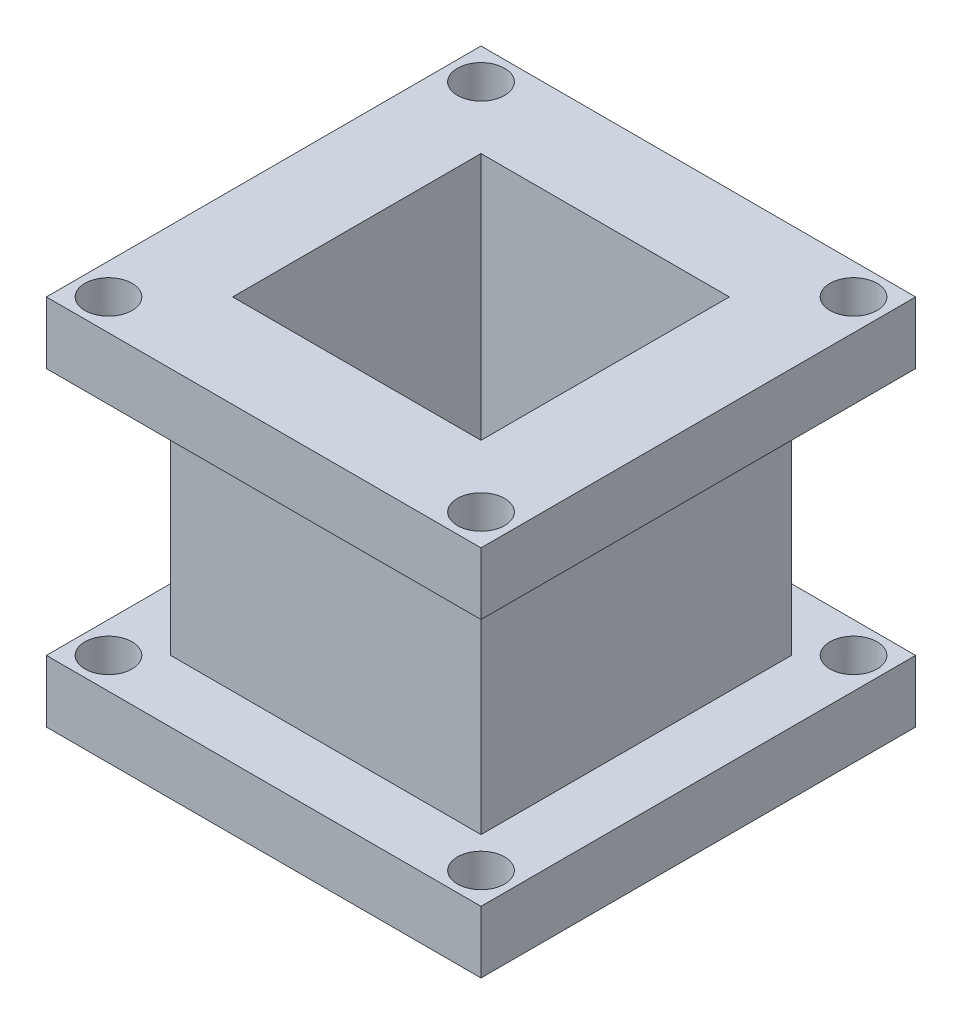
ISO-10303-21;
HEADER;
FILE_DESCRIPTION(('STEP AP214'),'2;1');
FILE_NAME('part.step','',(''),(''),'','','');
FILE_SCHEMA(('AUTOMOTIVE_DESIGN { 1 0 10303 214 1 1 1 1 }'));
ENDSEC;
DATA;
#1=APPLICATION_CONTEXT('core data for automotive mechanical design processes');
#2=APPLICATION_PROTOCOL_DEFINITION('international standard','automotive_design',2000,#1);
#3=PRODUCT_CONTEXT('',#1,'mechanical');
#4=PRODUCT('Part','Part','',(#3));
#5=PRODUCT_RELATED_PRODUCT_CATEGORY('part','',(#4));
#6=PRODUCT_DEFINITION_FORMATION('','',#4);
#7=PRODUCT_DEFINITION_CONTEXT('part definition',#1,'design');
#8=PRODUCT_DEFINITION('design','',#6,#7);
#9=PRODUCT_DEFINITION_SHAPE('','',#8);
#10=(LENGTH_UNIT() NAMED_UNIT(*) SI_UNIT(.MILLI.,.METRE.));
#11=(NAMED_UNIT(*) PLANE_ANGLE_UNIT() SI_UNIT($,.RADIAN.));
#12=(NAMED_UNIT(*) SI_UNIT($,.STERADIAN.) SOLID_ANGLE_UNIT());
#13=UNCERTAINTY_MEASURE_WITH_UNIT(LENGTH_MEASURE(1.E-05),#10,'distance_accuracy_value','');
#14=(GEOMETRIC_REPRESENTATION_CONTEXT(3) GLOBAL_UNCERTAINTY_ASSIGNED_CONTEXT((#13)) GLOBAL_UNIT_ASSIGNED_CONTEXT((#10,
#11,#12)) REPRESENTATION_CONTEXT('',''));
#15=CARTESIAN_POINT('',(0.,0.,0.));
#16=DIRECTION('',(0.,0.,1.));
#17=DIRECTION('',(1.,0.,0.));
#18=AXIS2_PLACEMENT_3D('',#15,#16,#17);
#19=CARTESIAN_POINT('',(22.225,6.35,22.225));
#20=DIRECTION('',(-1.,0.,0.));
#21=DIRECTION('',(0.,0.,1.));
#22=AXIS2_PLACEMENT_3D('',#19,#20,#21);
#23=PLANE('',#22);
#24=DIRECTION('',(0.,0.,-1.));
#25=VECTOR('',#24,1.);
#26=CARTESIAN_POINT('',(22.225,0.,22.225));
#27=LINE('',#26,#25);
#28=CARTESIAN_POINT('',(22.225,0.,22.225));
#29=VERTEX_POINT('',#28);
#30=CARTESIAN_POINT('',(22.225,0.,-22.225));
#31=VERTEX_POINT('',#30);
#32=EDGE_CURVE('E242',#29,#31,#27,.T.);
#33=ORIENTED_EDGE('',*,*,#32,.T.);
#34=DIRECTION('',(0.,-1.,0.));
#35=VECTOR('',#34,1.);
#36=CARTESIAN_POINT('',(22.225,6.35,-22.225));
#37=LINE('',#36,#35);
#38=CARTESIAN_POINT('',(22.225,6.35,-22.225));
#39=VERTEX_POINT('',#38);
#40=EDGE_CURVE('E11',#39,#31,#37,.T.);
#41=ORIENTED_EDGE('',*,*,#40,.F.);
#42=DIRECTION('',(0.,0.,-1.));
#43=VECTOR('',#42,1.);
#44=CARTESIAN_POINT('',(22.225,6.35,22.225));
#45=LINE('',#44,#43);
#46=CARTESIAN_POINT('',(22.225,6.35,22.225));
#47=VERTEX_POINT('',#46);
#48=EDGE_CURVE('E249',#47,#39,#45,.T.);
#49=ORIENTED_EDGE('',*,*,#48,.F.);
#50=DIRECTION('',(0.,-1.,0.));
#51=VECTOR('',#50,1.);
#52=CARTESIAN_POINT('',(22.225,6.35,22.225));
#53=LINE('',#52,#51);
#54=EDGE_CURVE('E259',#47,#29,#53,.T.);
#55=ORIENTED_EDGE('',*,*,#54,.T.);
#56=EDGE_LOOP('',(#33,#41,#49,#55));
#57=FACE_BOUND('',#56,.T.);
#58=ADVANCED_FACE('F35',(#57),#23,.F.);
#59=CARTESIAN_POINT('',(-22.225,6.35,-22.225));
#60=DIRECTION('',(0.,0.,1.));
#61=DIRECTION('',(1.,0.,0.));
#62=AXIS2_PLACEMENT_3D('',#59,#60,#61);
#63=PLANE('',#62);
#64=DIRECTION('',(-1.,0.,0.));
#65=VECTOR('',#64,1.);
#66=CARTESIAN_POINT('',(-22.225,0.,-22.225));
#67=LINE('',#66,#65);
#68=CARTESIAN_POINT('',(-22.225,0.,-22.225));
#69=VERTEX_POINT('',#68);
#70=EDGE_CURVE('E262',#31,#69,#67,.T.);
#71=ORIENTED_EDGE('',*,*,#70,.T.);
#72=DIRECTION('',(0.,-1.,0.));
#73=VECTOR('',#72,1.);
#74=CARTESIAN_POINT('',(-22.225,6.35,-22.225));
#75=LINE('',#74,#73);
#76=CARTESIAN_POINT('',(-22.225,6.35,-22.225));
#77=VERTEX_POINT('',#76);
#78=EDGE_CURVE('E42',#77,#69,#75,.T.);
#79=ORIENTED_EDGE('',*,*,#78,.F.);
#80=DIRECTION('',(-1.,0.,0.));
#81=VECTOR('',#80,1.);
#82=CARTESIAN_POINT('',(-22.225,6.35,-22.225));
#83=LINE('',#82,#81);
#84=EDGE_CURVE('E252',#39,#77,#83,.T.);
#85=ORIENTED_EDGE('',*,*,#84,.F.);
#86=ORIENTED_EDGE('',*,*,#40,.T.);
#87=EDGE_LOOP('',(#71,#79,#85,#86));
#88=FACE_BOUND('',#87,.T.);
#89=ADVANCED_FACE('F290',(#88),#63,.F.);
#90=CARTESIAN_POINT('',(-22.225,6.35,22.225));
#91=DIRECTION('',(1.,0.,0.));
#92=DIRECTION('',(0.,0.,-1.));
#93=AXIS2_PLACEMENT_3D('',#90,#91,#92);
#94=PLANE('',#93);
#95=DIRECTION('',(0.,0.,1.));
#96=VECTOR('',#95,1.);
#97=CARTESIAN_POINT('',(-22.225,0.,22.225));
#98=LINE('',#97,#96);
#99=CARTESIAN_POINT('',(-22.225,0.,22.225));
#100=VERTEX_POINT('',#99);
#101=EDGE_CURVE('E264',#69,#100,#98,.T.);
#102=ORIENTED_EDGE('',*,*,#101,.T.);
#103=DIRECTION('',(0.,-1.,0.));
#104=VECTOR('',#103,1.);
#105=CARTESIAN_POINT('',(-22.225,6.35,22.225));
#106=LINE('',#105,#104);
#107=CARTESIAN_POINT('',(-22.225,6.35,22.225));
#108=VERTEX_POINT('',#107);
#109=EDGE_CURVE('E269',#108,#100,#106,.T.);
#110=ORIENTED_EDGE('',*,*,#109,.F.);
#111=DIRECTION('',(0.,0.,1.));
#112=VECTOR('',#111,1.);
#113=CARTESIAN_POINT('',(-22.225,6.35,22.225));
#114=LINE('',#113,#112);
#115=EDGE_CURVE('E255',#77,#108,#114,.T.);
#116=ORIENTED_EDGE('',*,*,#115,.F.);
#117=ORIENTED_EDGE('',*,*,#78,.T.);
#118=EDGE_LOOP('',(#102,#110,#116,#117));
#119=FACE_BOUND('',#118,.T.);
#120=ADVANCED_FACE('F276',(#119),#94,.F.);
#121=CARTESIAN_POINT('',(-22.225,6.35,22.225));
#122=DIRECTION('',(0.,0.,-1.));
#123=DIRECTION('',(-1.,0.,0.));
#124=AXIS2_PLACEMENT_3D('',#121,#122,#123);
#125=PLANE('',#124);
#126=DIRECTION('',(1.,0.,0.));
#127=VECTOR('',#126,1.);
#128=CARTESIAN_POINT('',(-22.225,0.,22.225));
#129=LINE('',#128,#127);
#130=EDGE_CURVE('E253',#100,#29,#129,.T.);
#131=ORIENTED_EDGE('',*,*,#130,.T.);
#132=ORIENTED_EDGE('',*,*,#54,.F.);
#133=DIRECTION('',(1.,0.,0.));
#134=VECTOR('',#133,1.);
#135=CARTESIAN_POINT('',(-22.225,6.35,22.225));
#136=LINE('',#135,#134);
#137=EDGE_CURVE('E257',#108,#47,#136,.T.);
#138=ORIENTED_EDGE('',*,*,#137,.F.);
#139=ORIENTED_EDGE('',*,*,#109,.T.);
#140=EDGE_LOOP('',(#131,#132,#138,#139));
#141=FACE_BOUND('',#140,.T.);
#142=ADVANCED_FACE('F283',(#141),#125,.F.);
#143=CARTESIAN_POINT('',(0.,6.35,0.));
#144=DIRECTION('',(0.,-1.,0.));
#145=DIRECTION('',(0.,0.,-1.));
#146=AXIS2_PLACEMENT_3D('',#143,#144,#145);
#147=PLANE('',#146);
#148=CARTESIAN_POINT('',(19.0499999999999,6.35,-19.0500000000001));
#149=DIRECTION('',(0.,-1.,0.));
#150=DIRECTION('',(0.,0.,-1.));
#151=AXIS2_PLACEMENT_3D('',#148,#149,#150);
#152=CIRCLE('',#151,2.413);
#153=CARTESIAN_POINT('',(19.0499999999999,6.35,-21.4630000000001));
#154=VERTEX_POINT('',#153);
#155=EDGE_CURVE('E394',#154,#154,#152,.T.);
#156=ORIENTED_EDGE('',*,*,#155,.T.);
#157=EDGE_LOOP('',(#156));
#158=FACE_BOUND('',#157,.T.);
#159=CARTESIAN_POINT('',(-19.05,6.35,-19.05));
#160=DIRECTION('',(0.,-1.,0.));
#161=DIRECTION('',(0.,0.,-1.));
#162=AXIS2_PLACEMENT_3D('',#159,#160,#161);
#163=CIRCLE('',#162,2.413);
#164=CARTESIAN_POINT('',(-19.05,6.35,-21.463));
#165=VERTEX_POINT('',#164);
#166=EDGE_CURVE('E401',#165,#165,#163,.T.);
#167=ORIENTED_EDGE('',*,*,#166,.T.);
#168=EDGE_LOOP('',(#167));
#169=FACE_BOUND('',#168,.T.);
#170=CARTESIAN_POINT('',(-19.0499999999998,6.35,19.0500000000002));
#171=DIRECTION('',(0.,-1.,0.));
#172=DIRECTION('',(0.,0.,-1.));
#173=AXIS2_PLACEMENT_3D('',#170,#171,#172);
#174=CIRCLE('',#173,2.413);
#175=CARTESIAN_POINT('',(-19.0499999999998,6.35,16.6370000000002));
#176=VERTEX_POINT('',#175);
#177=EDGE_CURVE('E613',#176,#176,#174,.T.);
#178=ORIENTED_EDGE('',*,*,#177,.T.);
#179=EDGE_LOOP('',(#178));
#180=FACE_BOUND('',#179,.T.);
#181=CARTESIAN_POINT('',(19.05,6.35,19.05));
#182=DIRECTION('',(0.,-1.,0.));
#183=DIRECTION('',(0.,0.,-1.));
#184=AXIS2_PLACEMENT_3D('',#181,#182,#183);
#185=CIRCLE('',#184,2.413);
#186=CARTESIAN_POINT('',(19.05,6.35,16.637));
#187=VERTEX_POINT('',#186);
#188=EDGE_CURVE('E171',#187,#187,#185,.T.);
#189=ORIENTED_EDGE('',*,*,#188,.T.);
#190=EDGE_LOOP('',(#189));
#191=FACE_BOUND('',#190,.T.);
#192=DIRECTION('',(0.,0.,-1.));
#193=VECTOR('',#192,1.);
#194=CARTESIAN_POINT('',(-15.875,6.35,15.875));
#195=LINE('',#194,#193);
#196=CARTESIAN_POINT('',(-15.875,6.35,15.875));
#197=VERTEX_POINT('',#196);
#198=CARTESIAN_POINT('',(-15.875,6.35,-15.875));
#199=VERTEX_POINT('',#198);
#200=EDGE_CURVE('E220',#197,#199,#195,.T.);
#201=ORIENTED_EDGE('',*,*,#200,.T.);
#202=DIRECTION('',(1.,0.,0.));
#203=VECTOR('',#202,1.);
#204=CARTESIAN_POINT('',(-15.875,6.35,-15.875));
#205=LINE('',#204,#203);
#206=CARTESIAN_POINT('',(15.875,6.35,-15.875));
#207=VERTEX_POINT('',#206);
#208=EDGE_CURVE('E216',#199,#207,#205,.T.);
#209=ORIENTED_EDGE('',*,*,#208,.T.);
#210=DIRECTION('',(0.,0.,-1.));
#211=VECTOR('',#210,1.);
#212=CARTESIAN_POINT('',(15.875,6.35,15.875));
#213=LINE('',#212,#211);
#214=CARTESIAN_POINT('',(15.875,6.35,15.875));
#215=VERTEX_POINT('',#214);
#216=EDGE_CURVE('E232',#215,#207,#213,.T.);
#217=ORIENTED_EDGE('',*,*,#216,.F.);
#218=DIRECTION('',(1.,0.,0.));
#219=VECTOR('',#218,1.);
#220=CARTESIAN_POINT('',(-15.875,6.35,15.875));
#221=LINE('',#220,#219);
#222=EDGE_CURVE('E235',#197,#215,#221,.T.);
#223=ORIENTED_EDGE('',*,*,#222,.F.);
#224=EDGE_LOOP('',(#201,#209,#217,#223));
#225=FACE_BOUND('',#224,.T.);
#226=ORIENTED_EDGE('',*,*,#48,.T.);
#227=ORIENTED_EDGE('',*,*,#84,.T.);
#228=ORIENTED_EDGE('',*,*,#115,.T.);
#229=ORIENTED_EDGE('',*,*,#137,.T.);
#230=EDGE_LOOP('',(#226,#227,#228,#229));
#231=FACE_BOUND('',#230,.T.);
#232=ADVANCED_FACE('F289',(#158,#169,#180,#191,#225,#231),#147,.F.);
#233=CARTESIAN_POINT('',(0.,0.,0.));
#234=DIRECTION('',(0.,-1.,0.));
#235=DIRECTION('',(0.,0.,-1.));
#236=AXIS2_PLACEMENT_3D('',#233,#234,#235);
#237=PLANE('',#236);
#238=CARTESIAN_POINT('',(19.0499999999999,0.,-19.0500000000001));
#239=DIRECTION('',(0.,-1.,0.));
#240=DIRECTION('',(-1.,0.,0.));
#241=AXIS2_PLACEMENT_3D('',#238,#239,#240);
#242=CIRCLE('',#241,2.413);
#243=CARTESIAN_POINT('',(16.6369999999999,0.,-19.0500000000001));
#244=VERTEX_POINT('',#243);
#245=EDGE_CURVE('E391',#244,#244,#242,.T.);
#246=ORIENTED_EDGE('',*,*,#245,.F.);
#247=EDGE_LOOP('',(#246));
#248=FACE_BOUND('',#247,.T.);
#249=CARTESIAN_POINT('',(-19.05,0.,-19.05));
#250=DIRECTION('',(0.,-1.,0.));
#251=DIRECTION('',(0.,0.,1.));
#252=AXIS2_PLACEMENT_3D('',#249,#250,#251);
#253=CIRCLE('',#252,2.413);
#254=CARTESIAN_POINT('',(-19.05,0.,-16.637));
#255=VERTEX_POINT('',#254);
#256=EDGE_CURVE('E623',#255,#255,#253,.T.);
#257=ORIENTED_EDGE('',*,*,#256,.F.);
#258=EDGE_LOOP('',(#257));
#259=FACE_BOUND('',#258,.T.);
#260=CARTESIAN_POINT('',(-19.0499999999998,0.,19.0500000000002));
#261=DIRECTION('',(0.,-1.,0.));
#262=DIRECTION('',(1.,0.,0.));
#263=AXIS2_PLACEMENT_3D('',#260,#261,#262);
#264=CIRCLE('',#263,2.413);
#265=CARTESIAN_POINT('',(-16.6369999999998,0.,19.0500000000002));
#266=VERTEX_POINT('',#265);
#267=EDGE_CURVE('E624',#266,#266,#264,.T.);
#268=ORIENTED_EDGE('',*,*,#267,.F.);
#269=EDGE_LOOP('',(#268));
#270=FACE_BOUND('',#269,.T.);
#271=CARTESIAN_POINT('',(19.05,0.,19.05));
#272=DIRECTION('',(0.,-1.,0.));
#273=DIRECTION('',(0.,0.,-1.));
#274=AXIS2_PLACEMENT_3D('',#271,#272,#273);
#275=CIRCLE('',#274,2.413);
#276=CARTESIAN_POINT('',(19.05,0.,16.637));
#277=VERTEX_POINT('',#276);
#278=EDGE_CURVE('E395',#277,#277,#275,.T.);
#279=ORIENTED_EDGE('',*,*,#278,.F.);
#280=EDGE_LOOP('',(#279));
#281=FACE_BOUND('',#280,.T.);
#282=DIRECTION('',(0.,0.,-1.));
#283=VECTOR('',#282,1.);
#284=CARTESIAN_POINT('',(12.7,0.,12.7));
#285=LINE('',#284,#283);
#286=CARTESIAN_POINT('',(12.7,0.,12.7));
#287=VERTEX_POINT('',#286);
#288=CARTESIAN_POINT('',(12.7,0.,-12.7));
#289=VERTEX_POINT('',#288);
#290=EDGE_CURVE('E149',#287,#289,#285,.T.);
#291=ORIENTED_EDGE('',*,*,#290,.T.);
#292=DIRECTION('',(-1.,0.,0.));
#293=VECTOR('',#292,1.);
#294=CARTESIAN_POINT('',(-12.7,0.,-12.7));
#295=LINE('',#294,#293);
#296=CARTESIAN_POINT('',(-12.7,0.,-12.7));
#297=VERTEX_POINT('',#296);
#298=EDGE_CURVE('E158',#289,#297,#295,.T.);
#299=ORIENTED_EDGE('',*,*,#298,.T.);
#300=DIRECTION('',(0.,0.,1.));
#301=VECTOR('',#300,1.);
#302=CARTESIAN_POINT('',(-12.7,0.,12.7));
#303=LINE('',#302,#301);
#304=CARTESIAN_POINT('',(-12.7,0.,12.7));
#305=VERTEX_POINT('',#304);
#306=EDGE_CURVE('E49',#297,#305,#303,.T.);
#307=ORIENTED_EDGE('',*,*,#306,.T.);
#308=DIRECTION('',(1.,0.,0.));
#309=VECTOR('',#308,1.);
#310=CARTESIAN_POINT('',(-12.7,0.,12.7));
#311=LINE('',#310,#309);
#312=EDGE_CURVE('E155',#305,#287,#311,.T.);
#313=ORIENTED_EDGE('',*,*,#312,.T.);
#314=EDGE_LOOP('',(#291,#299,#307,#313));
#315=FACE_BOUND('',#314,.T.);
#316=ORIENTED_EDGE('',*,*,#32,.F.);
#317=ORIENTED_EDGE('',*,*,#130,.F.);
#318=ORIENTED_EDGE('',*,*,#101,.F.);
#319=ORIENTED_EDGE('',*,*,#70,.F.);
#320=EDGE_LOOP('',(#316,#317,#318,#319));
#321=FACE_BOUND('',#320,.T.);
#322=ADVANCED_FACE('F162',(#248,#259,#270,#281,#315,#321),#237,.T.);
#323=CARTESIAN_POINT('',(-15.875,31.75,-15.875));
#324=DIRECTION('',(0.,0.,-1.));
#325=DIRECTION('',(-1.,0.,0.));
#326=AXIS2_PLACEMENT_3D('',#323,#324,#325);
#327=PLANE('',#326);
#328=ORIENTED_EDGE('',*,*,#208,.F.);
#329=DIRECTION('',(0.,-1.,0.));
#330=VECTOR('',#329,1.);
#331=CARTESIAN_POINT('',(-15.875,31.75,-15.875));
#332=LINE('',#331,#330);
#333=CARTESIAN_POINT('',(-15.875,31.75,-15.875));
#334=VERTEX_POINT('',#333);
#335=EDGE_CURVE('E239',#334,#199,#332,.T.);
#336=ORIENTED_EDGE('',*,*,#335,.F.);
#337=DIRECTION('',(1.,0.,0.));
#338=VECTOR('',#337,1.);
#339=CARTESIAN_POINT('',(-15.875,31.75,-15.875));
#340=LINE('',#339,#338);
#341=CARTESIAN_POINT('',(15.875,31.75,-15.875));
#342=VERTEX_POINT('',#341);
#343=EDGE_CURVE('E217',#334,#342,#340,.T.);
#344=ORIENTED_EDGE('',*,*,#343,.T.);
#345=DIRECTION('',(0.,-1.,0.));
#346=VECTOR('',#345,1.);
#347=CARTESIAN_POINT('',(15.875,31.75,-15.875));
#348=LINE('',#347,#346);
#349=EDGE_CURVE('E229',#342,#207,#348,.T.);
#350=ORIENTED_EDGE('',*,*,#349,.T.);
#351=EDGE_LOOP('',(#328,#336,#344,#350));
#352=FACE_BOUND('',#351,.T.);
#353=ADVANCED_FACE('F302',(#352),#327,.T.);
#354=CARTESIAN_POINT('',(-15.875,31.75,15.875));
#355=DIRECTION('',(-1.,0.,0.));
#356=DIRECTION('',(0.,0.,1.));
#357=AXIS2_PLACEMENT_3D('',#354,#355,#356);
#358=PLANE('',#357);
#359=ORIENTED_EDGE('',*,*,#200,.F.);
#360=DIRECTION('',(0.,-1.,0.));
#361=VECTOR('',#360,1.);
#362=CARTESIAN_POINT('',(-15.875,31.75,15.875));
#363=LINE('',#362,#361);
#364=CARTESIAN_POINT('',(-15.875,31.75,15.875));
#365=VERTEX_POINT('',#364);
#366=EDGE_CURVE('E243',#365,#197,#363,.T.);
#367=ORIENTED_EDGE('',*,*,#366,.F.);
#368=DIRECTION('',(0.,0.,-1.));
#369=VECTOR('',#368,1.);
#370=CARTESIAN_POINT('',(-15.875,31.75,15.875));
#371=LINE('',#370,#369);
#372=EDGE_CURVE('E226',#365,#334,#371,.T.);
#373=ORIENTED_EDGE('',*,*,#372,.T.);
#374=ORIENTED_EDGE('',*,*,#335,.T.);
#375=EDGE_LOOP('',(#359,#367,#373,#374));
#376=FACE_BOUND('',#375,.T.);
#377=ADVANCED_FACE('F309',(#376),#358,.T.);
#378=CARTESIAN_POINT('',(-15.875,31.75,15.875));
#379=DIRECTION('',(0.,0.,-1.));
#380=DIRECTION('',(-1.,0.,0.));
#381=AXIS2_PLACEMENT_3D('',#378,#379,#380);
#382=PLANE('',#381);
#383=ORIENTED_EDGE('',*,*,#222,.T.);
#384=DIRECTION('',(0.,-1.,0.));
#385=VECTOR('',#384,1.);
#386=CARTESIAN_POINT('',(15.875,31.75,15.875));
#387=LINE('',#386,#385);
#388=CARTESIAN_POINT('',(15.875,31.75,15.875));
#389=VERTEX_POINT('',#388);
#390=EDGE_CURVE('E245',#389,#215,#387,.T.);
#391=ORIENTED_EDGE('',*,*,#390,.F.);
#392=DIRECTION('',(1.,0.,0.));
#393=VECTOR('',#392,1.);
#394=CARTESIAN_POINT('',(-15.875,31.75,15.875));
#395=LINE('',#394,#393);
#396=EDGE_CURVE('E223',#365,#389,#395,.T.);
#397=ORIENTED_EDGE('',*,*,#396,.F.);
#398=ORIENTED_EDGE('',*,*,#366,.T.);
#399=EDGE_LOOP('',(#383,#391,#397,#398));
#400=FACE_BOUND('',#399,.T.);
#401=ADVANCED_FACE('F315',(#400),#382,.F.);
#402=CARTESIAN_POINT('',(15.875,31.75,15.875));
#403=DIRECTION('',(-1.,0.,0.));
#404=DIRECTION('',(0.,0.,1.));
#405=AXIS2_PLACEMENT_3D('',#402,#403,#404);
#406=PLANE('',#405);
#407=ORIENTED_EDGE('',*,*,#216,.T.);
#408=ORIENTED_EDGE('',*,*,#349,.F.);
#409=DIRECTION('',(0.,0.,-1.));
#410=VECTOR('',#409,1.);
#411=CARTESIAN_POINT('',(15.875,31.75,15.875));
#412=LINE('',#411,#410);
#413=EDGE_CURVE('E219',#389,#342,#412,.T.);
#414=ORIENTED_EDGE('',*,*,#413,.F.);
#415=ORIENTED_EDGE('',*,*,#390,.T.);
#416=EDGE_LOOP('',(#407,#408,#414,#415));
#417=FACE_BOUND('',#416,.T.);
#418=ADVANCED_FACE('F311',(#417),#406,.F.);
#419=CARTESIAN_POINT('',(0.,31.75,0.));
#420=DIRECTION('',(0.,-1.,0.));
#421=DIRECTION('',(0.,0.,-1.));
#422=AXIS2_PLACEMENT_3D('',#419,#420,#421);
#423=PLANE('',#422);
#424=CARTESIAN_POINT('',(19.0499999999999,31.75,-19.0500000000001));
#425=DIRECTION('',(0.,-1.,0.));
#426=DIRECTION('',(0.,0.,-1.));
#427=AXIS2_PLACEMENT_3D('',#424,#425,#426);
#428=CIRCLE('',#427,2.413);
#429=CARTESIAN_POINT('',(19.0499999999999,31.75,-21.4630000000001));
#430=VERTEX_POINT('',#429);
#431=EDGE_CURVE('E396',#430,#430,#428,.T.);
#432=ORIENTED_EDGE('',*,*,#431,.F.);
#433=EDGE_LOOP('',(#432));
#434=FACE_BOUND('',#433,.T.);
#435=CARTESIAN_POINT('',(-19.05,31.75,-19.05));
#436=DIRECTION('',(0.,-1.,0.));
#437=DIRECTION('',(0.,0.,-1.));
#438=AXIS2_PLACEMENT_3D('',#435,#436,#437);
#439=CIRCLE('',#438,2.413);
#440=CARTESIAN_POINT('',(-19.05,31.75,-21.463));
#441=VERTEX_POINT('',#440);
#442=EDGE_CURVE('E610',#441,#441,#439,.T.);
#443=ORIENTED_EDGE('',*,*,#442,.F.);
#444=EDGE_LOOP('',(#443));
#445=FACE_BOUND('',#444,.T.);
#446=CARTESIAN_POINT('',(-19.0499999999998,31.75,19.0500000000002));
#447=DIRECTION('',(0.,-1.,0.));
#448=DIRECTION('',(0.,0.,-1.));
#449=AXIS2_PLACEMENT_3D('',#446,#447,#448);
#450=CIRCLE('',#449,2.413);
#451=CARTESIAN_POINT('',(-19.0499999999998,31.75,16.6370000000002));
#452=VERTEX_POINT('',#451);
#453=EDGE_CURVE('E616',#452,#452,#450,.T.);
#454=ORIENTED_EDGE('',*,*,#453,.F.);
#455=EDGE_LOOP('',(#454));
#456=FACE_BOUND('',#455,.T.);
#457=CARTESIAN_POINT('',(19.05,31.75,19.05));
#458=DIRECTION('',(0.,-1.,0.));
#459=DIRECTION('',(0.,0.,-1.));
#460=AXIS2_PLACEMENT_3D('',#457,#458,#459);
#461=CIRCLE('',#460,2.413);
#462=CARTESIAN_POINT('',(19.05,31.75,16.637));
#463=VERTEX_POINT('',#462);
#464=EDGE_CURVE('E406',#463,#463,#461,.T.);
#465=ORIENTED_EDGE('',*,*,#464,.F.);
#466=EDGE_LOOP('',(#465));
#467=FACE_BOUND('',#466,.T.);
#468=DIRECTION('',(0.,0.,-1.));
#469=VECTOR('',#468,1.);
#470=CARTESIAN_POINT('',(22.225,31.75,22.225));
#471=LINE('',#470,#469);
#472=CARTESIAN_POINT('',(22.225,31.75,22.225));
#473=VERTEX_POINT('',#472);
#474=CARTESIAN_POINT('',(22.225,31.75,-22.225));
#475=VERTEX_POINT('',#474);
#476=EDGE_CURVE('E183',#473,#475,#471,.T.);
#477=ORIENTED_EDGE('',*,*,#476,.F.);
#478=DIRECTION('',(1.,0.,0.));
#479=VECTOR('',#478,1.);
#480=CARTESIAN_POINT('',(-22.225,31.75,22.225));
#481=LINE('',#480,#479);
#482=CARTESIAN_POINT('',(-22.225,31.75,22.225));
#483=VERTEX_POINT('',#482);
#484=EDGE_CURVE('E191',#483,#473,#481,.T.);
#485=ORIENTED_EDGE('',*,*,#484,.F.);
#486=DIRECTION('',(0.,0.,1.));
#487=VECTOR('',#486,1.);
#488=CARTESIAN_POINT('',(-22.225,31.75,22.225));
#489=LINE('',#488,#487);
#490=CARTESIAN_POINT('',(-22.225,31.75,-22.225));
#491=VERTEX_POINT('',#490);
#492=EDGE_CURVE('E202',#491,#483,#489,.T.);
#493=ORIENTED_EDGE('',*,*,#492,.F.);
#494=DIRECTION('',(-1.,0.,0.));
#495=VECTOR('',#494,1.);
#496=CARTESIAN_POINT('',(-22.225,31.75,-22.225));
#497=LINE('',#496,#495);
#498=EDGE_CURVE('E200',#475,#491,#497,.T.);
#499=ORIENTED_EDGE('',*,*,#498,.F.);
#500=EDGE_LOOP('',(#477,#485,#493,#499));
#501=FACE_BOUND('',#500,.T.);
#502=ORIENTED_EDGE('',*,*,#343,.F.);
#503=ORIENTED_EDGE('',*,*,#372,.F.);
#504=ORIENTED_EDGE('',*,*,#396,.T.);
#505=ORIENTED_EDGE('',*,*,#413,.T.);
#506=EDGE_LOOP('',(#502,#503,#504,#505));
#507=FACE_BOUND('',#506,.T.);
#508=ADVANCED_FACE('F314',(#434,#445,#456,#467,#501,#507),#423,.T.);
#509=CARTESIAN_POINT('',(22.225,38.1,22.225));
#510=DIRECTION('',(-1.,0.,0.));
#511=DIRECTION('',(0.,0.,1.));
#512=AXIS2_PLACEMENT_3D('',#509,#510,#511);
#513=PLANE('',#512);
#514=ORIENTED_EDGE('',*,*,#476,.T.);
#515=DIRECTION('',(0.,-1.,0.));
#516=VECTOR('',#515,1.);
#517=CARTESIAN_POINT('',(22.225,38.1,-22.225));
#518=LINE('',#517,#516);
#519=CARTESIAN_POINT('',(22.225,38.1,-22.225));
#520=VERTEX_POINT('',#519);
#521=EDGE_CURVE('E213',#520,#475,#518,.T.);
#522=ORIENTED_EDGE('',*,*,#521,.F.);
#523=DIRECTION('',(0.,0.,-1.));
#524=VECTOR('',#523,1.);
#525=CARTESIAN_POINT('',(22.225,38.1,22.225));
#526=LINE('',#525,#524);
#527=CARTESIAN_POINT('',(22.225,38.1,22.225));
#528=VERTEX_POINT('',#527);
#529=EDGE_CURVE('E187',#528,#520,#526,.T.);
#530=ORIENTED_EDGE('',*,*,#529,.F.);
#531=DIRECTION('',(0.,-1.,0.));
#532=VECTOR('',#531,1.);
#533=CARTESIAN_POINT('',(22.225,38.1,22.225));
#534=LINE('',#533,#532);
#535=EDGE_CURVE('E197',#528,#473,#534,.T.);
#536=ORIENTED_EDGE('',*,*,#535,.T.);
#537=EDGE_LOOP('',(#514,#522,#530,#536));
#538=FACE_BOUND('',#537,.T.);
#539=ADVANCED_FACE('F323',(#538),#513,.F.);
#540=CARTESIAN_POINT('',(-22.225,38.1,-22.225));
#541=DIRECTION('',(0.,0.,1.));
#542=DIRECTION('',(1.,0.,0.));
#543=AXIS2_PLACEMENT_3D('',#540,#541,#542);
#544=PLANE('',#543);
#545=ORIENTED_EDGE('',*,*,#498,.T.);
#546=DIRECTION('',(0.,-1.,0.));
#547=VECTOR('',#546,1.);
#548=CARTESIAN_POINT('',(-22.225,38.1,-22.225));
#549=LINE('',#548,#547);
#550=CARTESIAN_POINT('',(-22.225,38.1,-22.225));
#551=VERTEX_POINT('',#550);
#552=EDGE_CURVE('E210',#551,#491,#549,.T.);
#553=ORIENTED_EDGE('',*,*,#552,.F.);
#554=DIRECTION('',(-1.,0.,0.));
#555=VECTOR('',#554,1.);
#556=CARTESIAN_POINT('',(-22.225,38.1,-22.225));
#557=LINE('',#556,#555);
#558=EDGE_CURVE('E190',#520,#551,#557,.T.);
#559=ORIENTED_EDGE('',*,*,#558,.F.);
#560=ORIENTED_EDGE('',*,*,#521,.T.);
#561=EDGE_LOOP('',(#545,#553,#559,#560));
#562=FACE_BOUND('',#561,.T.);
#563=ADVANCED_FACE('F326',(#562),#544,.F.);
#564=CARTESIAN_POINT('',(-22.225,38.1,22.225));
#565=DIRECTION('',(1.,0.,0.));
#566=DIRECTION('',(0.,0.,-1.));
#567=AXIS2_PLACEMENT_3D('',#564,#565,#566);
#568=PLANE('',#567);
#569=ORIENTED_EDGE('',*,*,#492,.T.);
#570=DIRECTION('',(0.,-1.,0.));
#571=VECTOR('',#570,1.);
#572=CARTESIAN_POINT('',(-22.225,38.1,22.225));
#573=LINE('',#572,#571);
#574=CARTESIAN_POINT('',(-22.225,38.1,22.225));
#575=VERTEX_POINT('',#574);
#576=EDGE_CURVE('E207',#575,#483,#573,.T.);
#577=ORIENTED_EDGE('',*,*,#576,.F.);
#578=DIRECTION('',(0.,0.,1.));
#579=VECTOR('',#578,1.);
#580=CARTESIAN_POINT('',(-22.225,38.1,22.225));
#581=LINE('',#580,#579);
#582=EDGE_CURVE('E193',#551,#575,#581,.T.);
#583=ORIENTED_EDGE('',*,*,#582,.F.);
#584=ORIENTED_EDGE('',*,*,#552,.T.);
#585=EDGE_LOOP('',(#569,#577,#583,#584));
#586=FACE_BOUND('',#585,.T.);
#587=ADVANCED_FACE('F330',(#586),#568,.F.);
#588=CARTESIAN_POINT('',(-22.225,38.1,22.225));
#589=DIRECTION('',(0.,0.,-1.));
#590=DIRECTION('',(-1.,0.,0.));
#591=AXIS2_PLACEMENT_3D('',#588,#589,#590);
#592=PLANE('',#591);
#593=ORIENTED_EDGE('',*,*,#484,.T.);
#594=ORIENTED_EDGE('',*,*,#535,.F.);
#595=DIRECTION('',(1.,0.,0.));
#596=VECTOR('',#595,1.);
#597=CARTESIAN_POINT('',(-22.225,38.1,22.225));
#598=LINE('',#597,#596);
#599=EDGE_CURVE('E195',#575,#528,#598,.T.);
#600=ORIENTED_EDGE('',*,*,#599,.F.);
#601=ORIENTED_EDGE('',*,*,#576,.T.);
#602=EDGE_LOOP('',(#593,#594,#600,#601));
#603=FACE_BOUND('',#602,.T.);
#604=ADVANCED_FACE('F334',(#603),#592,.F.);
#605=CARTESIAN_POINT('',(0.,38.1,0.));
#606=DIRECTION('',(0.,-1.,0.));
#607=DIRECTION('',(0.,0.,-1.));
#608=AXIS2_PLACEMENT_3D('',#605,#606,#607);
#609=PLANE('',#608);
#610=CARTESIAN_POINT('',(19.0499999999999,38.1,-19.0500000000001));
#611=DIRECTION('',(0.,-1.,0.));
#612=DIRECTION('',(-1.,0.,0.));
#613=AXIS2_PLACEMENT_3D('',#610,#611,#612);
#614=CIRCLE('',#613,2.413);
#615=CARTESIAN_POINT('',(16.6369999999999,38.1,-19.0500000000001));
#616=VERTEX_POINT('',#615);
#617=EDGE_CURVE('E619',#616,#616,#614,.T.);
#618=ORIENTED_EDGE('',*,*,#617,.T.);
#619=EDGE_LOOP('',(#618));
#620=FACE_BOUND('',#619,.T.);
#621=CARTESIAN_POINT('',(-19.05,38.1,-19.05));
#622=DIRECTION('',(0.,-1.,0.));
#623=DIRECTION('',(0.,0.,1.));
#624=AXIS2_PLACEMENT_3D('',#621,#622,#623);
#625=CIRCLE('',#624,2.413);
#626=CARTESIAN_POINT('',(-19.05,38.1,-16.637));
#627=VERTEX_POINT('',#626);
#628=EDGE_CURVE('E627',#627,#627,#625,.T.);
#629=ORIENTED_EDGE('',*,*,#628,.T.);
#630=EDGE_LOOP('',(#629));
#631=FACE_BOUND('',#630,.T.);
#632=CARTESIAN_POINT('',(-19.0499999999998,38.1,19.0500000000002));
#633=DIRECTION('',(0.,-1.,0.));
#634=DIRECTION('',(1.,0.,0.));
#635=AXIS2_PLACEMENT_3D('',#632,#633,#634);
#636=CIRCLE('',#635,2.413);
#637=CARTESIAN_POINT('',(-16.6369999999998,38.1,19.0500000000002));
#638=VERTEX_POINT('',#637);
#639=EDGE_CURVE('E620',#638,#638,#636,.T.);
#640=ORIENTED_EDGE('',*,*,#639,.T.);
#641=EDGE_LOOP('',(#640));
#642=FACE_BOUND('',#641,.T.);
#643=CARTESIAN_POINT('',(19.05,38.1,19.05));
#644=DIRECTION('',(0.,-1.,0.));
#645=DIRECTION('',(0.,0.,-1.));
#646=AXIS2_PLACEMENT_3D('',#643,#644,#645);
#647=CIRCLE('',#646,2.413);
#648=CARTESIAN_POINT('',(19.05,38.1,16.637));
#649=VERTEX_POINT('',#648);
#650=EDGE_CURVE('E399',#649,#649,#647,.T.);
#651=ORIENTED_EDGE('',*,*,#650,.T.);
#652=EDGE_LOOP('',(#651));
#653=FACE_BOUND('',#652,.T.);
#654=DIRECTION('',(-1.,0.,0.));
#655=VECTOR('',#654,1.);
#656=CARTESIAN_POINT('',(-12.7,38.1,-12.7));
#657=LINE('',#656,#655);
#658=CARTESIAN_POINT('',(12.7,38.1,-12.7));
#659=VERTEX_POINT('',#658);
#660=CARTESIAN_POINT('',(-12.7,38.1,-12.7));
#661=VERTEX_POINT('',#660);
#662=EDGE_CURVE('E177',#659,#661,#657,.T.);
#663=ORIENTED_EDGE('',*,*,#662,.F.);
#664=DIRECTION('',(0.,0.,-1.));
#665=VECTOR('',#664,1.);
#666=CARTESIAN_POINT('',(12.7,38.1,12.7));
#667=LINE('',#666,#665);
#668=CARTESIAN_POINT('',(12.7,38.1,12.7));
#669=VERTEX_POINT('',#668);
#670=EDGE_CURVE('E57',#669,#659,#667,.T.);
#671=ORIENTED_EDGE('',*,*,#670,.F.);
#672=DIRECTION('',(1.,0.,0.));
#673=VECTOR('',#672,1.);
#674=CARTESIAN_POINT('',(-12.7,38.1,12.7));
#675=LINE('',#674,#673);
#676=CARTESIAN_POINT('',(-12.7,38.1,12.7));
#677=VERTEX_POINT('',#676);
#678=EDGE_CURVE('E165',#677,#669,#675,.T.);
#679=ORIENTED_EDGE('',*,*,#678,.F.);
#680=DIRECTION('',(0.,0.,1.));
#681=VECTOR('',#680,1.);
#682=CARTESIAN_POINT('',(-12.7,38.1,12.7));
#683=LINE('',#682,#681);
#684=EDGE_CURVE('E168',#661,#677,#683,.T.);
#685=ORIENTED_EDGE('',*,*,#684,.F.);
#686=EDGE_LOOP('',(#663,#671,#679,#685));
#687=FACE_BOUND('',#686,.T.);
#688=ORIENTED_EDGE('',*,*,#529,.T.);
#689=ORIENTED_EDGE('',*,*,#558,.T.);
#690=ORIENTED_EDGE('',*,*,#582,.T.);
#691=ORIENTED_EDGE('',*,*,#599,.T.);
#692=EDGE_LOOP('',(#688,#689,#690,#691));
#693=FACE_BOUND('',#692,.T.);
#694=ADVANCED_FACE('F338',(#620,#631,#642,#653,#687,#693),#609,.F.);
#695=CARTESIAN_POINT('',(12.7,0.,12.7));
#696=DIRECTION('',(1.,0.,0.));
#697=DIRECTION('',(0.,0.,-1.));
#698=AXIS2_PLACEMENT_3D('',#695,#696,#697);
#699=PLANE('',#698);
#700=ORIENTED_EDGE('',*,*,#670,.T.);
#701=DIRECTION('',(0.,1.,0.));
#702=VECTOR('',#701,1.);
#703=CARTESIAN_POINT('',(12.7,0.,-12.7));
#704=LINE('',#703,#702);
#705=EDGE_CURVE('E145',#289,#659,#704,.T.);
#706=ORIENTED_EDGE('',*,*,#705,.F.);
#707=ORIENTED_EDGE('',*,*,#290,.F.);
#708=DIRECTION('',(0.,1.,0.));
#709=VECTOR('',#708,1.);
#710=CARTESIAN_POINT('',(12.7,0.,12.7));
#711=LINE('',#710,#709);
#712=EDGE_CURVE('E181',#287,#669,#711,.T.);
#713=ORIENTED_EDGE('',*,*,#712,.T.);
#714=EDGE_LOOP('',(#700,#706,#707,#713));
#715=FACE_BOUND('',#714,.T.);
#716=ADVANCED_FACE('F147',(#715),#699,.F.);
#717=CARTESIAN_POINT('',(-12.7,0.,12.7));
#718=DIRECTION('',(0.,0.,1.));
#719=DIRECTION('',(1.,0.,0.));
#720=AXIS2_PLACEMENT_3D('',#717,#718,#719);
#721=PLANE('',#720);
#722=ORIENTED_EDGE('',*,*,#678,.T.);
#723=ORIENTED_EDGE('',*,*,#712,.F.);
#724=ORIENTED_EDGE('',*,*,#312,.F.);
#725=DIRECTION('',(0.,1.,0.));
#726=VECTOR('',#725,1.);
#727=CARTESIAN_POINT('',(-12.7,0.,12.7));
#728=LINE('',#727,#726);
#729=EDGE_CURVE('E184',#305,#677,#728,.T.);
#730=ORIENTED_EDGE('',*,*,#729,.T.);
#731=EDGE_LOOP('',(#722,#723,#724,#730));
#732=FACE_BOUND('',#731,.T.);
#733=ADVANCED_FACE('F348',(#732),#721,.F.);
#734=CARTESIAN_POINT('',(-12.7,0.,12.7));
#735=DIRECTION('',(-1.,0.,0.));
#736=DIRECTION('',(0.,0.,1.));
#737=AXIS2_PLACEMENT_3D('',#734,#735,#736);
#738=PLANE('',#737);
#739=ORIENTED_EDGE('',*,*,#684,.T.);
#740=ORIENTED_EDGE('',*,*,#729,.F.);
#741=ORIENTED_EDGE('',*,*,#306,.F.);
#742=DIRECTION('',(0.,1.,0.));
#743=VECTOR('',#742,1.);
#744=CARTESIAN_POINT('',(-12.7,0.,-12.7));
#745=LINE('',#744,#743);
#746=EDGE_CURVE('E154',#297,#661,#745,.T.);
#747=ORIENTED_EDGE('',*,*,#746,.T.);
#748=EDGE_LOOP('',(#739,#740,#741,#747));
#749=FACE_BOUND('',#748,.T.);
#750=ADVANCED_FACE('F352',(#749),#738,.F.);
#751=CARTESIAN_POINT('',(-12.7,0.,-12.7));
#752=DIRECTION('',(0.,0.,-1.));
#753=DIRECTION('',(-1.,0.,0.));
#754=AXIS2_PLACEMENT_3D('',#751,#752,#753);
#755=PLANE('',#754);
#756=ORIENTED_EDGE('',*,*,#662,.T.);
#757=ORIENTED_EDGE('',*,*,#746,.F.);
#758=ORIENTED_EDGE('',*,*,#298,.F.);
#759=ORIENTED_EDGE('',*,*,#705,.T.);
#760=EDGE_LOOP('',(#756,#757,#758,#759));
#761=FACE_BOUND('',#760,.T.);
#762=ADVANCED_FACE('F159',(#761),#755,.F.);
#763=CARTESIAN_POINT('',(19.05,38.1,19.05));
#764=DIRECTION('',(0.,-1.,0.));
#765=DIRECTION('',(0.,0.,-1.));
#766=AXIS2_PLACEMENT_3D('',#763,#764,#765);
#767=CYLINDRICAL_SURFACE('',#766,2.413);
#768=ORIENTED_EDGE('',*,*,#464,.T.);
#769=EDGE_LOOP('',(#768));
#770=FACE_BOUND('',#769,.T.);
#771=ORIENTED_EDGE('',*,*,#650,.F.);
#772=EDGE_LOOP('',(#771));
#773=FACE_BOUND('',#772,.T.);
#774=ADVANCED_FACE('F351',(#770,#773),#767,.F.);
#775=ORIENTED_EDGE('',*,*,#278,.T.);
#776=EDGE_LOOP('',(#775));
#777=FACE_BOUND('',#776,.T.);
#778=ORIENTED_EDGE('',*,*,#188,.F.);
#779=EDGE_LOOP('',(#778));
#780=FACE_BOUND('',#779,.T.);
#781=ADVANCED_FACE('F360',(#777,#780),#767,.F.);
#782=CARTESIAN_POINT('',(-19.0499999999998,38.1,19.0500000000002));
#783=DIRECTION('',(0.,-1.,0.));
#784=DIRECTION('',(0.,0.,-1.));
#785=AXIS2_PLACEMENT_3D('',#782,#783,#784);
#786=CYLINDRICAL_SURFACE('',#785,2.413);
#787=ORIENTED_EDGE('',*,*,#453,.T.);
#788=EDGE_LOOP('',(#787));
#789=FACE_BOUND('',#788,.T.);
#790=ORIENTED_EDGE('',*,*,#639,.F.);
#791=EDGE_LOOP('',(#790));
#792=FACE_BOUND('',#791,.T.);
#793=ADVANCED_FACE('F362',(#789,#792),#786,.F.);
#794=CARTESIAN_POINT('',(-19.05,38.1,-19.05));
#795=DIRECTION('',(0.,-1.,0.));
#796=DIRECTION('',(0.,0.,-1.));
#797=AXIS2_PLACEMENT_3D('',#794,#795,#796);
#798=CYLINDRICAL_SURFACE('',#797,2.413);
#799=ORIENTED_EDGE('',*,*,#442,.T.);
#800=EDGE_LOOP('',(#799));
#801=FACE_BOUND('',#800,.T.);
#802=ORIENTED_EDGE('',*,*,#628,.F.);
#803=EDGE_LOOP('',(#802));
#804=FACE_BOUND('',#803,.T.);
#805=ADVANCED_FACE('F365',(#801,#804),#798,.F.);
#806=CARTESIAN_POINT('',(19.0499999999999,38.1,-19.0500000000001));
#807=DIRECTION('',(0.,-1.,0.));
#808=DIRECTION('',(0.,0.,-1.));
#809=AXIS2_PLACEMENT_3D('',#806,#807,#808);
#810=CYLINDRICAL_SURFACE('',#809,2.413);
#811=ORIENTED_EDGE('',*,*,#431,.T.);
#812=EDGE_LOOP('',(#811));
#813=FACE_BOUND('',#812,.T.);
#814=ORIENTED_EDGE('',*,*,#617,.F.);
#815=EDGE_LOOP('',(#814));
#816=FACE_BOUND('',#815,.T.);
#817=ADVANCED_FACE('F370',(#813,#816),#810,.F.);
#818=ORIENTED_EDGE('',*,*,#267,.T.);
#819=EDGE_LOOP('',(#818));
#820=FACE_BOUND('',#819,.T.);
#821=ORIENTED_EDGE('',*,*,#177,.F.);
#822=EDGE_LOOP('',(#821));
#823=FACE_BOUND('',#822,.T.);
#824=ADVANCED_FACE('F367',(#820,#823),#786,.F.);
#825=ORIENTED_EDGE('',*,*,#256,.T.);
#826=EDGE_LOOP('',(#825));
#827=FACE_BOUND('',#826,.T.);
#828=ORIENTED_EDGE('',*,*,#166,.F.);
#829=EDGE_LOOP('',(#828));
#830=FACE_BOUND('',#829,.T.);
#831=ADVANCED_FACE('F372',(#827,#830),#798,.F.);
#832=ORIENTED_EDGE('',*,*,#245,.T.);
#833=EDGE_LOOP('',(#832));
#834=FACE_BOUND('',#833,.T.);
#835=ORIENTED_EDGE('',*,*,#155,.F.);
#836=EDGE_LOOP('',(#835));
#837=FACE_BOUND('',#836,.T.);
#838=ADVANCED_FACE('F375',(#834,#837),#810,.F.);
#839=CLOSED_SHELL('',(#58,#89,#120,#142,#232,#322,#353,#377,#401,#418,#508,#539,#563,#587,#604,
#694,#716,#733,#750,#762,#774,#781,#793,#805,#817,#824,#831,#838));
#840=MANIFOLD_SOLID_BREP('B2',#839);
#841=ADVANCED_BREP_SHAPE_REPRESENTATION('',(#18,#840),#14);
#842=SHAPE_DEFINITION_REPRESENTATION(#9,#841);
ENDSEC;
END-ISO-10303-21;
